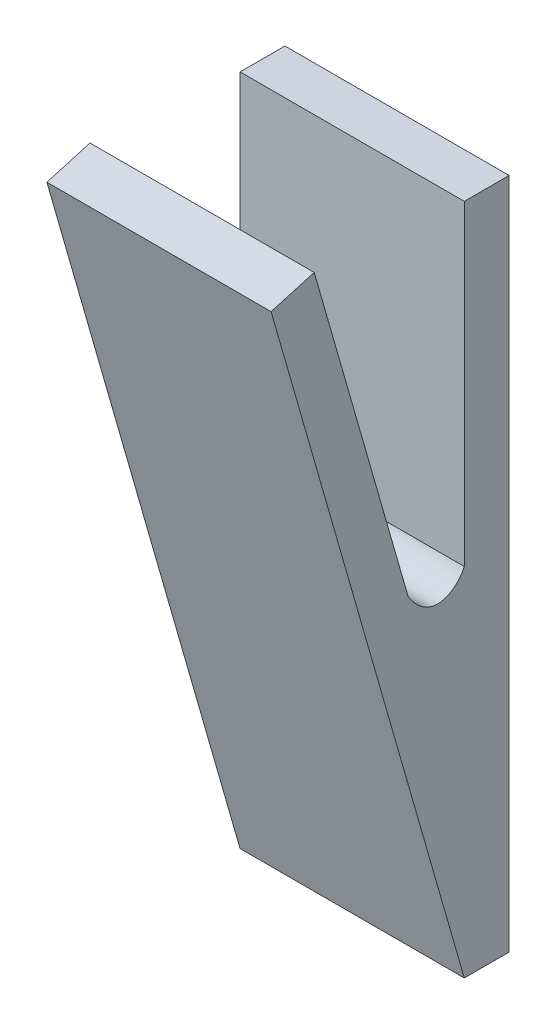
ISO-10303-21;
HEADER;
FILE_DESCRIPTION(('STEP AP214'),'2;1');
FILE_NAME('part.step','',(''),(''),'','','');
FILE_SCHEMA(('AUTOMOTIVE_DESIGN { 1 0 10303 214 1 1 1 1 }'));
ENDSEC;
DATA;
#1=APPLICATION_CONTEXT('core data for automotive mechanical design processes');
#2=APPLICATION_PROTOCOL_DEFINITION('international standard','automotive_design',2000,#1);
#3=PRODUCT_CONTEXT('',#1,'mechanical');
#4=PRODUCT('Part','Part','',(#3));
#5=PRODUCT_RELATED_PRODUCT_CATEGORY('part','',(#4));
#6=PRODUCT_DEFINITION_FORMATION('','',#4);
#7=PRODUCT_DEFINITION_CONTEXT('part definition',#1,'design');
#8=PRODUCT_DEFINITION('design','',#6,#7);
#9=PRODUCT_DEFINITION_SHAPE('','',#8);
#10=(LENGTH_UNIT() NAMED_UNIT(*) SI_UNIT(.MILLI.,.METRE.));
#11=(NAMED_UNIT(*) PLANE_ANGLE_UNIT() SI_UNIT($,.RADIAN.));
#12=(NAMED_UNIT(*) SI_UNIT($,.STERADIAN.) SOLID_ANGLE_UNIT());
#13=UNCERTAINTY_MEASURE_WITH_UNIT(LENGTH_MEASURE(1.E-05),#10,'distance_accuracy_value','');
#14=(GEOMETRIC_REPRESENTATION_CONTEXT(3) GLOBAL_UNCERTAINTY_ASSIGNED_CONTEXT((#13)) GLOBAL_UNIT_ASSIGNED_CONTEXT((#10,
#11,#12)) REPRESENTATION_CONTEXT('',''));
#15=CARTESIAN_POINT('',(0.,0.,0.));
#16=DIRECTION('',(0.,0.,1.));
#17=DIRECTION('',(1.,0.,0.));
#18=AXIS2_PLACEMENT_3D('',#15,#16,#17);
#19=CARTESIAN_POINT('',(0.,0.,2.));
#20=DIRECTION('',(0.,0.,1.));
#21=DIRECTION('',(1.,0.,0.));
#22=AXIS2_PLACEMENT_3D('',#19,#20,#21);
#23=PLANE('',#22);
#24=DIRECTION('',(-1.,0.,0.));
#25=VECTOR('',#24,1.);
#26=CARTESIAN_POINT('',(4.45497630331753,6.25067597499197,2.));
#27=LINE('',#26,#25);
#28=CARTESIAN_POINT('',(4.45497630331753,6.25067597499197,2.));
#29=VERTEX_POINT('',#28);
#30=CARTESIAN_POINT('',(-5.54502369668247,6.25067597499197,2.));
#31=VERTEX_POINT('',#30);
#32=EDGE_CURVE('E111',#29,#31,#27,.T.);
#33=ORIENTED_EDGE('',*,*,#32,.F.);
#34=DIRECTION('',(0.,1.,0.));
#35=VECTOR('',#34,1.);
#36=CARTESIAN_POINT('',(4.45497630331753,20.3554502369668,2.));
#37=LINE('',#36,#35);
#38=CARTESIAN_POINT('',(4.45497630331753,20.3554502369668,2.));
#39=VERTEX_POINT('',#38);
#40=EDGE_CURVE('E119',#29,#39,#37,.T.);
#41=ORIENTED_EDGE('',*,*,#40,.T.);
#42=DIRECTION('',(-1.,0.,0.));
#43=VECTOR('',#42,1.);
#44=CARTESIAN_POINT('',(-5.54502369668247,20.3554502369668,2.));
#45=LINE('',#44,#43);
#46=CARTESIAN_POINT('',(-5.54502369668247,20.3554502369668,2.));
#47=VERTEX_POINT('',#46);
#48=EDGE_CURVE('E50',#39,#47,#45,.T.);
#49=ORIENTED_EDGE('',*,*,#48,.T.);
#50=DIRECTION('',(0.,-1.,0.));
#51=VECTOR('',#50,1.);
#52=CARTESIAN_POINT('',(-5.54502369668247,20.3554502369668,2.));
#53=LINE('',#52,#51);
#54=EDGE_CURVE('E121',#47,#31,#53,.T.);
#55=ORIENTED_EDGE('',*,*,#54,.T.);
#56=EDGE_LOOP('',(#33,#41,#49,#55));
#57=FACE_BOUND('',#56,.T.);
#58=ADVANCED_FACE('F33',(#57),#23,.T.);
#59=CARTESIAN_POINT('',(-5.54502369668247,20.3554502369668,2.));
#60=DIRECTION('',(1.,0.,0.));
#61=DIRECTION('',(0.,1.,0.));
#62=AXIS2_PLACEMENT_3D('',#59,#60,#61);
#63=PLANE('',#62);
#64=DIRECTION('',(0.,0.,-1.));
#65=VECTOR('',#64,1.);
#66=CARTESIAN_POINT('',(-5.54502369668247,-9.64454976303318,2.));
#67=LINE('',#66,#65);
#68=CARTESIAN_POINT('',(-5.54502369668247,-9.64454976303318,2.));
#69=VERTEX_POINT('',#68);
#70=CARTESIAN_POINT('',(-5.54502369668247,-9.64454976303318,0.));
#71=VERTEX_POINT('',#70);
#72=EDGE_CURVE('E11',#69,#71,#67,.T.);
#73=ORIENTED_EDGE('',*,*,#72,.F.);
#74=DIRECTION('',(0.,-0.961261695938319,-0.275637355817));
#75=VECTOR('',#74,1.);
#76=CARTESIAN_POINT('',(-5.54502369668247,20.403507869008,10.6161418770026));
#77=LINE('',#76,#75);
#78=CARTESIAN_POINT('',(-5.54502369668247,20.403507869008,10.6161418770026));
#79=VERTEX_POINT('',#78);
#80=EDGE_CURVE('E191',#79,#69,#77,.T.);
#81=ORIENTED_EDGE('',*,*,#80,.F.);
#82=DIRECTION('',(0.,-0.275637355817,0.961261695938319));
#83=VECTOR('',#82,1.);
#84=CARTESIAN_POINT('',(-5.54502369668247,20.954782580642,8.69361848512592));
#85=LINE('',#84,#83);
#86=CARTESIAN_POINT('',(-5.54502369668247,20.954782580642,8.69361848512592));
#87=VERTEX_POINT('',#86);
#88=EDGE_CURVE('E135',#87,#79,#85,.T.);
#89=ORIENTED_EDGE('',*,*,#88,.F.);
#90=DIRECTION('',(0.,-0.961261695938319,-0.275637355817));
#91=VECTOR('',#90,1.);
#92=CARTESIAN_POINT('',(-5.54502369668247,20.954782580642,8.69361848512592));
#93=LINE('',#92,#91);
#94=CARTESIAN_POINT('',(-5.54502369668247,6.31875676315525,4.49680561611481));
#95=VERTEX_POINT('',#94);
#96=EDGE_CURVE('E193',#87,#95,#93,.T.);
#97=ORIENTED_EDGE('',*,*,#96,.T.);
#98=CARTESIAN_POINT('',(-5.54502369668247,6.31875676315526,4.49680561611481));
#99=CARTESIAN_POINT('',(-5.54502369668247,4.61845435816743,3.39046742735208));
#100=CARTESIAN_POINT('',(-5.54502369668247,5.68194172069887,2.21082109239101));
#101=CARTESIAN_POINT('',(-5.54502369668247,6.25067597499197,2.));
#102=B_SPLINE_CURVE_WITH_KNOTS('',3,(#98,#99,#100,#101),.UNSPECIFIED.,.F.,.F.,(4,4),(0.,1.),.UNSPECIFIED.);
#103=EDGE_CURVE('E117',#95,#31,#102,.T.);
#104=ORIENTED_EDGE('',*,*,#103,.T.);
#105=ORIENTED_EDGE('',*,*,#54,.F.);
#106=DIRECTION('',(0.,0.,-1.));
#107=VECTOR('',#106,1.);
#108=CARTESIAN_POINT('',(-5.54502369668247,20.3554502369668,2.));
#109=LINE('',#108,#107);
#110=CARTESIAN_POINT('',(-5.54502369668247,20.3554502369668,0.));
#111=VERTEX_POINT('',#110);
#112=EDGE_CURVE('E126',#47,#111,#109,.T.);
#113=ORIENTED_EDGE('',*,*,#112,.T.);
#114=DIRECTION('',(0.,-1.,0.));
#115=VECTOR('',#114,1.);
#116=CARTESIAN_POINT('',(-5.54502369668247,20.3554502369668,0.));
#117=LINE('',#116,#115);
#118=EDGE_CURVE('E131',#111,#71,#117,.T.);
#119=ORIENTED_EDGE('',*,*,#118,.T.);
#120=EDGE_LOOP('',(#73,#81,#89,#97,#104,#105,#113,#119));
#121=FACE_BOUND('',#120,.T.);
#122=ADVANCED_FACE('F35',(#121),#63,.F.);
#123=CARTESIAN_POINT('',(-5.54502369668247,-9.64454976303318,2.));
#124=DIRECTION('',(0.,1.,0.));
#125=DIRECTION('',(0.,0.,1.));
#126=AXIS2_PLACEMENT_3D('',#123,#124,#125);
#127=PLANE('',#126);
#128=DIRECTION('',(1.,0.,0.));
#129=VECTOR('',#128,1.);
#130=CARTESIAN_POINT('',(-5.54502369668247,-9.64454976303318,0.));
#131=LINE('',#130,#129);
#132=CARTESIAN_POINT('',(4.45497630331753,-9.64454976303318,0.));
#133=VERTEX_POINT('',#132);
#134=EDGE_CURVE('E134',#71,#133,#131,.T.);
#135=ORIENTED_EDGE('',*,*,#134,.T.);
#136=DIRECTION('',(0.,0.,-1.));
#137=VECTOR('',#136,1.);
#138=CARTESIAN_POINT('',(4.45497630331753,-9.64454976303318,2.));
#139=LINE('',#138,#137);
#140=CARTESIAN_POINT('',(4.45497630331753,-9.64454976303318,2.));
#141=VERTEX_POINT('',#140);
#142=EDGE_CURVE('E42',#141,#133,#139,.T.);
#143=ORIENTED_EDGE('',*,*,#142,.F.);
#144=DIRECTION('',(1.,0.,0.));
#145=VECTOR('',#144,1.);
#146=CARTESIAN_POINT('',(-5.54502369668247,-9.64454976303318,2.));
#147=LINE('',#146,#145);
#148=EDGE_CURVE('E79',#69,#141,#147,.T.);
#149=ORIENTED_EDGE('',*,*,#148,.F.);
#150=ORIENTED_EDGE('',*,*,#72,.T.);
#151=EDGE_LOOP('',(#135,#143,#149,#150));
#152=FACE_BOUND('',#151,.T.);
#153=ADVANCED_FACE('F158',(#152),#127,.F.);
#154=CARTESIAN_POINT('',(4.45497630331753,20.3554502369668,2.));
#155=DIRECTION('',(-1.,0.,0.));
#156=DIRECTION('',(0.,-1.,0.));
#157=AXIS2_PLACEMENT_3D('',#154,#155,#156);
#158=PLANE('',#157);
#159=ORIENTED_EDGE('',*,*,#40,.F.);
#160=CARTESIAN_POINT('',(4.45497630331753,6.31875676315526,4.49680561611481));
#161=CARTESIAN_POINT('',(4.45497630331753,4.61845435816744,3.39046742735208));
#162=CARTESIAN_POINT('',(4.45497630331753,5.68194172069887,2.21082109239101));
#163=CARTESIAN_POINT('',(4.45497630331753,6.25067597499197,2.));
#164=B_SPLINE_CURVE_WITH_KNOTS('',3,(#160,#161,#162,#163),.UNSPECIFIED.,.F.,.F.,(4,4),(0.,1.),.UNSPECIFIED.);
#165=CARTESIAN_POINT('',(4.45497630331753,6.31875676315525,4.49680561611481));
#166=VERTEX_POINT('',#165);
#167=EDGE_CURVE('E108',#166,#29,#164,.T.);
#168=ORIENTED_EDGE('',*,*,#167,.F.);
#169=DIRECTION('',(0.,0.961261695938319,0.275637355817));
#170=VECTOR('',#169,1.);
#171=CARTESIAN_POINT('',(4.45497630331753,20.954782580642,8.69361848512592));
#172=LINE('',#171,#170);
#173=CARTESIAN_POINT('',(4.45497630331753,20.954782580642,8.69361848512592));
#174=VERTEX_POINT('',#173);
#175=EDGE_CURVE('E196',#166,#174,#172,.T.);
#176=ORIENTED_EDGE('',*,*,#175,.T.);
#177=DIRECTION('',(0.,-0.275637355817,0.961261695938319));
#178=VECTOR('',#177,1.);
#179=CARTESIAN_POINT('',(4.45497630331753,20.954782580642,8.69361848512592));
#180=LINE('',#179,#178);
#181=CARTESIAN_POINT('',(4.45497630331753,20.403507869008,10.6161418770026));
#182=VERTEX_POINT('',#181);
#183=EDGE_CURVE('E202',#174,#182,#180,.T.);
#184=ORIENTED_EDGE('',*,*,#183,.T.);
#185=DIRECTION('',(0.,0.961261695938319,0.275637355817));
#186=VECTOR('',#185,1.);
#187=CARTESIAN_POINT('',(4.45497630331753,20.403507869008,10.6161418770026));
#188=LINE('',#187,#186);
#189=EDGE_CURVE('E142',#141,#182,#188,.T.);
#190=ORIENTED_EDGE('',*,*,#189,.F.);
#191=ORIENTED_EDGE('',*,*,#142,.T.);
#192=DIRECTION('',(0.,1.,0.));
#193=VECTOR('',#192,1.);
#194=CARTESIAN_POINT('',(4.45497630331753,20.3554502369668,0.));
#195=LINE('',#194,#193);
#196=CARTESIAN_POINT('',(4.45497630331753,20.3554502369668,0.));
#197=VERTEX_POINT('',#196);
#198=EDGE_CURVE('E68',#133,#197,#195,.T.);
#199=ORIENTED_EDGE('',*,*,#198,.T.);
#200=DIRECTION('',(0.,0.,-1.));
#201=VECTOR('',#200,1.);
#202=CARTESIAN_POINT('',(4.45497630331753,20.3554502369668,2.));
#203=LINE('',#202,#201);
#204=EDGE_CURVE('E124',#39,#197,#203,.T.);
#205=ORIENTED_EDGE('',*,*,#204,.F.);
#206=EDGE_LOOP('',(#159,#168,#176,#184,#190,#191,#199,#205));
#207=FACE_BOUND('',#206,.T.);
#208=ADVANCED_FACE('F123',(#207),#158,.F.);
#209=CARTESIAN_POINT('',(-5.54502369668247,20.3554502369668,2.));
#210=DIRECTION('',(0.,-1.,0.));
#211=DIRECTION('',(0.,0.,-1.));
#212=AXIS2_PLACEMENT_3D('',#209,#210,#211);
#213=PLANE('',#212);
#214=DIRECTION('',(-1.,0.,0.));
#215=VECTOR('',#214,1.);
#216=CARTESIAN_POINT('',(-5.54502369668247,20.3554502369668,0.));
#217=LINE('',#216,#215);
#218=EDGE_CURVE('E73',#197,#111,#217,.T.);
#219=ORIENTED_EDGE('',*,*,#218,.T.);
#220=ORIENTED_EDGE('',*,*,#112,.F.);
#221=ORIENTED_EDGE('',*,*,#48,.F.);
#222=ORIENTED_EDGE('',*,*,#204,.T.);
#223=EDGE_LOOP('',(#219,#220,#221,#222));
#224=FACE_BOUND('',#223,.T.);
#225=ADVANCED_FACE('F149',(#224),#213,.F.);
#226=CARTESIAN_POINT('',(0.,0.,0.));
#227=DIRECTION('',(0.,0.,1.));
#228=DIRECTION('',(1.,0.,0.));
#229=AXIS2_PLACEMENT_3D('',#226,#227,#228);
#230=PLANE('',#229);
#231=ORIENTED_EDGE('',*,*,#118,.F.);
#232=ORIENTED_EDGE('',*,*,#218,.F.);
#233=ORIENTED_EDGE('',*,*,#198,.F.);
#234=ORIENTED_EDGE('',*,*,#134,.F.);
#235=EDGE_LOOP('',(#231,#232,#233,#234));
#236=FACE_BOUND('',#235,.T.);
#237=ADVANCED_FACE('F145',(#236),#230,.F.);
#238=CARTESIAN_POINT('',(-5.54502369668247,20.954782580642,8.69361848512592));
#239=DIRECTION('',(0.,0.961261695938319,0.275637355817));
#240=DIRECTION('',(0.,-0.275637355817,0.961261695938319));
#241=AXIS2_PLACEMENT_3D('',#238,#239,#240);
#242=PLANE('',#241);
#243=DIRECTION('',(-1.,0.,0.));
#244=VECTOR('',#243,1.);
#245=CARTESIAN_POINT('',(-5.54502369668247,20.403507869008,10.6161418770026));
#246=LINE('',#245,#244);
#247=EDGE_CURVE('E197',#182,#79,#246,.T.);
#248=ORIENTED_EDGE('',*,*,#247,.F.);
#249=ORIENTED_EDGE('',*,*,#183,.F.);
#250=DIRECTION('',(-1.,0.,0.));
#251=VECTOR('',#250,1.);
#252=CARTESIAN_POINT('',(-5.54502369668247,20.954782580642,8.69361848512592));
#253=LINE('',#252,#251);
#254=EDGE_CURVE('E199',#174,#87,#253,.T.);
#255=ORIENTED_EDGE('',*,*,#254,.T.);
#256=ORIENTED_EDGE('',*,*,#88,.T.);
#257=EDGE_LOOP('',(#248,#249,#255,#256));
#258=FACE_BOUND('',#257,.T.);
#259=ADVANCED_FACE('F156',(#258),#242,.T.);
#260=CARTESIAN_POINT('',(0.,-0.711398401702701,2.48094106142333));
#261=DIRECTION('',(0.,-0.275637355817,0.961261695938319));
#262=DIRECTION('',(0.,-0.961261695938319,-0.275637355817));
#263=AXIS2_PLACEMENT_3D('',#260,#261,#262);
#264=PLANE('',#263);
#265=ORIENTED_EDGE('',*,*,#175,.F.);
#266=DIRECTION('',(-1.,0.,0.));
#267=VECTOR('',#266,1.);
#268=CARTESIAN_POINT('',(4.45497630331753,6.31875676315525,4.49680561611481));
#269=LINE('',#268,#267);
#270=EDGE_CURVE('E114',#166,#95,#269,.T.);
#271=ORIENTED_EDGE('',*,*,#270,.T.);
#272=ORIENTED_EDGE('',*,*,#96,.F.);
#273=ORIENTED_EDGE('',*,*,#254,.F.);
#274=EDGE_LOOP('',(#265,#271,#272,#273));
#275=FACE_BOUND('',#274,.T.);
#276=ADVANCED_FACE('F168',(#275),#264,.F.);
#277=CARTESIAN_POINT('',(0.,-1.2626731133367,4.40346445329997));
#278=DIRECTION('',(0.,-0.275637355817,0.961261695938319));
#279=DIRECTION('',(0.,-0.961261695938319,-0.275637355817));
#280=AXIS2_PLACEMENT_3D('',#277,#278,#279);
#281=PLANE('',#280);
#282=ORIENTED_EDGE('',*,*,#80,.T.);
#283=ORIENTED_EDGE('',*,*,#148,.T.);
#284=ORIENTED_EDGE('',*,*,#189,.T.);
#285=ORIENTED_EDGE('',*,*,#247,.T.);
#286=EDGE_LOOP('',(#282,#283,#284,#285));
#287=FACE_BOUND('',#286,.T.);
#288=ADVANCED_FACE('F170',(#287),#281,.T.);
#289=DIRECTION('',(-1.,0.,0.));
#290=VECTOR('',#289,1.);
#291=SURFACE_OF_LINEAR_EXTRUSION('',#164,#290);
#292=ORIENTED_EDGE('',*,*,#103,.F.);
#293=ORIENTED_EDGE('',*,*,#270,.F.);
#294=ORIENTED_EDGE('',*,*,#167,.T.);
#295=ORIENTED_EDGE('',*,*,#32,.T.);
#296=EDGE_LOOP('',(#292,#293,#294,#295));
#297=FACE_BOUND('',#296,.T.);
#298=ADVANCED_FACE('F110',(#297),#291,.T.);
#299=CLOSED_SHELL('',(#58,#122,#153,#208,#225,#237,#259,#276,#288,#298));
#300=MANIFOLD_SOLID_BREP('B2',#299);
#301=ADVANCED_BREP_SHAPE_REPRESENTATION('',(#18,#300),#14);
#302=SHAPE_DEFINITION_REPRESENTATION(#9,#301);
ENDSEC;
END-ISO-10303-21;
